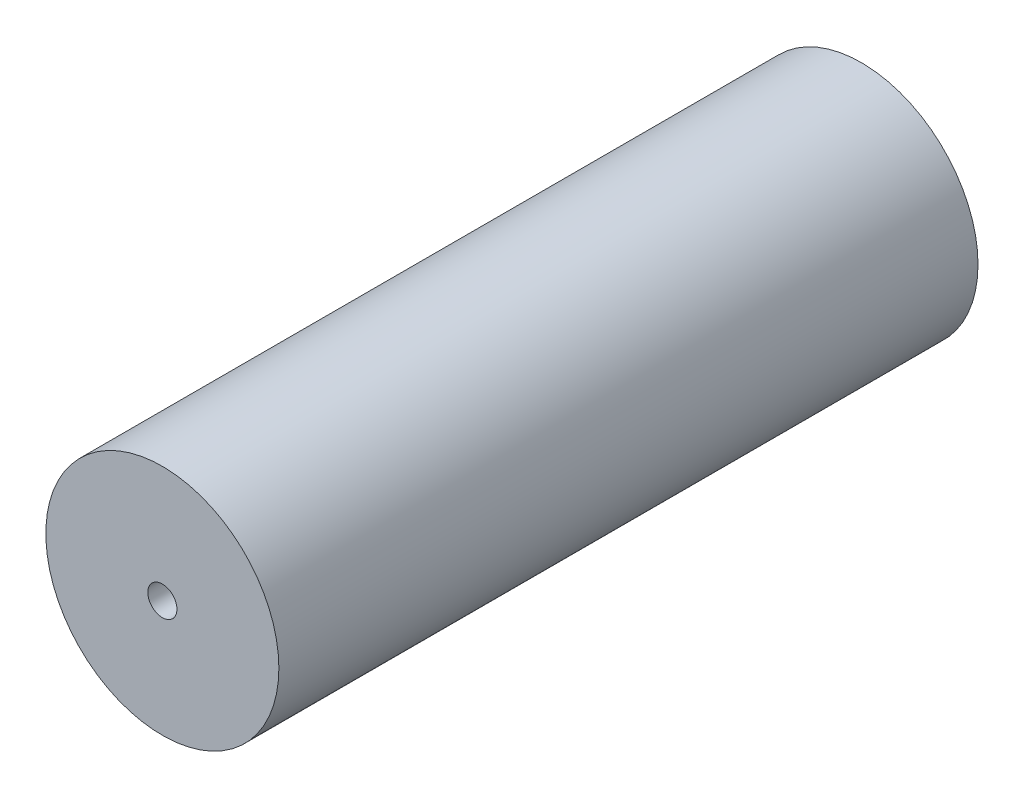
ISO-10303-21;
HEADER;
FILE_DESCRIPTION(('STEP AP214'),'2;1');
FILE_NAME('part.step','',(''),(''),'','','');
FILE_SCHEMA(('AUTOMOTIVE_DESIGN { 1 0 10303 214 1 1 1 1 }'));
ENDSEC;
DATA;
#1=APPLICATION_CONTEXT('core data for automotive mechanical design processes');
#2=APPLICATION_PROTOCOL_DEFINITION('international standard','automotive_design',2000,#1);
#3=PRODUCT_CONTEXT('',#1,'mechanical');
#4=PRODUCT('Part','Part','',(#3));
#5=PRODUCT_RELATED_PRODUCT_CATEGORY('part','',(#4));
#6=PRODUCT_DEFINITION_FORMATION('','',#4);
#7=PRODUCT_DEFINITION_CONTEXT('part definition',#1,'design');
#8=PRODUCT_DEFINITION('design','',#6,#7);
#9=PRODUCT_DEFINITION_SHAPE('','',#8);
#10=(LENGTH_UNIT() NAMED_UNIT(*) SI_UNIT(.MILLI.,.METRE.));
#11=(NAMED_UNIT(*) PLANE_ANGLE_UNIT() SI_UNIT($,.RADIAN.));
#12=(NAMED_UNIT(*) SI_UNIT($,.STERADIAN.) SOLID_ANGLE_UNIT());
#13=UNCERTAINTY_MEASURE_WITH_UNIT(LENGTH_MEASURE(1.E-05),#10,'distance_accuracy_value','');
#14=(GEOMETRIC_REPRESENTATION_CONTEXT(3) GLOBAL_UNCERTAINTY_ASSIGNED_CONTEXT((#13)) GLOBAL_UNIT_ASSIGNED_CONTEXT((#10,
#11,#12)) REPRESENTATION_CONTEXT('',''));
#15=CARTESIAN_POINT('',(0.,0.,0.));
#16=DIRECTION('',(0.,0.,1.));
#17=DIRECTION('',(1.,0.,0.));
#18=AXIS2_PLACEMENT_3D('',#15,#16,#17);
#19=CARTESIAN_POINT('',(0.,0.,152.4));
#20=DIRECTION('',(0.,0.,-1.));
#21=DIRECTION('',(-1.,0.,0.));
#22=AXIS2_PLACEMENT_3D('',#19,#20,#21);
#23=CYLINDRICAL_SURFACE('',#22,25.4);
#24=CARTESIAN_POINT('',(0.,0.,152.4));
#25=DIRECTION('',(0.,0.,1.));
#26=DIRECTION('',(1.,0.,0.));
#27=AXIS2_PLACEMENT_3D('',#24,#25,#26);
#28=CIRCLE('',#27,25.4);
#29=CARTESIAN_POINT('',(25.4,0.,152.4));
#30=VERTEX_POINT('',#29);
#31=EDGE_CURVE('E10',#30,#30,#28,.T.);
#32=ORIENTED_EDGE('',*,*,#31,.F.);
#33=EDGE_LOOP('',(#32));
#34=FACE_BOUND('',#33,.T.);
#35=CARTESIAN_POINT('',(0.,0.,0.));
#36=DIRECTION('',(0.,0.,1.));
#37=DIRECTION('',(1.,0.,0.));
#38=AXIS2_PLACEMENT_3D('',#35,#36,#37);
#39=CIRCLE('',#38,25.4);
#40=CARTESIAN_POINT('',(25.4,0.,0.));
#41=VERTEX_POINT('',#40);
#42=EDGE_CURVE('E39',#41,#41,#39,.T.);
#43=ORIENTED_EDGE('',*,*,#42,.T.);
#44=EDGE_LOOP('',(#43));
#45=FACE_BOUND('',#44,.T.);
#46=ADVANCED_FACE('F36',(#34,#45),#23,.T.);
#47=CARTESIAN_POINT('',(0.,0.,152.4));
#48=DIRECTION('',(0.,0.,1.));
#49=DIRECTION('',(1.,0.,0.));
#50=AXIS2_PLACEMENT_3D('',#47,#48,#49);
#51=PLANE('',#50);
#52=CARTESIAN_POINT('',(0.,0.,152.4));
#53=DIRECTION('',(0.,0.,1.));
#54=DIRECTION('',(1.,0.,0.));
#55=AXIS2_PLACEMENT_3D('',#52,#53,#54);
#56=CIRCLE('',#55,3.175);
#57=CARTESIAN_POINT('',(3.175,0.,152.4));
#58=VERTEX_POINT('',#57);
#59=EDGE_CURVE('E50',#58,#58,#56,.T.);
#60=ORIENTED_EDGE('',*,*,#59,.F.);
#61=EDGE_LOOP('',(#60));
#62=FACE_BOUND('',#61,.T.);
#63=ORIENTED_EDGE('',*,*,#31,.T.);
#64=EDGE_LOOP('',(#63));
#65=FACE_BOUND('',#64,.T.);
#66=ADVANCED_FACE('F67',(#62,#65),#51,.T.);
#67=CARTESIAN_POINT('',(0.,0.,0.));
#68=DIRECTION('',(0.,0.,1.));
#69=DIRECTION('',(1.,0.,0.));
#70=AXIS2_PLACEMENT_3D('',#67,#68,#69);
#71=PLANE('',#70);
#72=ORIENTED_EDGE('',*,*,#42,.F.);
#73=EDGE_LOOP('',(#72));
#74=FACE_BOUND('',#73,.T.);
#75=ADVANCED_FACE('F63',(#74),#71,.F.);
#76=CARTESIAN_POINT('',(0.,0.,127.));
#77=DIRECTION('',(0.,0.,1.));
#78=DIRECTION('',(1.,0.,0.));
#79=AXIS2_PLACEMENT_3D('',#76,#77,#78);
#80=CYLINDRICAL_SURFACE('',#79,3.175);
#81=CARTESIAN_POINT('',(0.,0.,127.));
#82=DIRECTION('',(0.,0.,1.));
#83=DIRECTION('',(1.,0.,0.));
#84=AXIS2_PLACEMENT_3D('',#81,#82,#83);
#85=CIRCLE('',#84,3.175);
#86=CARTESIAN_POINT('',(3.175,0.,127.));
#87=VERTEX_POINT('',#86);
#88=EDGE_CURVE('E48',#87,#87,#85,.T.);
#89=ORIENTED_EDGE('',*,*,#88,.F.);
#90=EDGE_LOOP('',(#89));
#91=FACE_BOUND('',#90,.T.);
#92=ORIENTED_EDGE('',*,*,#59,.T.);
#93=EDGE_LOOP('',(#92));
#94=FACE_BOUND('',#93,.T.);
#95=ADVANCED_FACE('F60',(#91,#94),#80,.F.);
#96=CARTESIAN_POINT('',(0.,0.,127.));
#97=DIRECTION('',(0.,0.,1.));
#98=DIRECTION('',(1.,0.,0.));
#99=AXIS2_PLACEMENT_3D('',#96,#97,#98);
#100=PLANE('',#99);
#101=ORIENTED_EDGE('',*,*,#88,.T.);
#102=EDGE_LOOP('',(#101));
#103=FACE_BOUND('',#102,.T.);
#104=ADVANCED_FACE('F58',(#103),#100,.T.);
#105=CLOSED_SHELL('',(#46,#66,#75,#95,#104));
#106=MANIFOLD_SOLID_BREP('B2',#105);
#107=ADVANCED_BREP_SHAPE_REPRESENTATION('',(#18,#106),#14);
#108=SHAPE_DEFINITION_REPRESENTATION(#9,#107);
ENDSEC;
END-ISO-10303-21;
